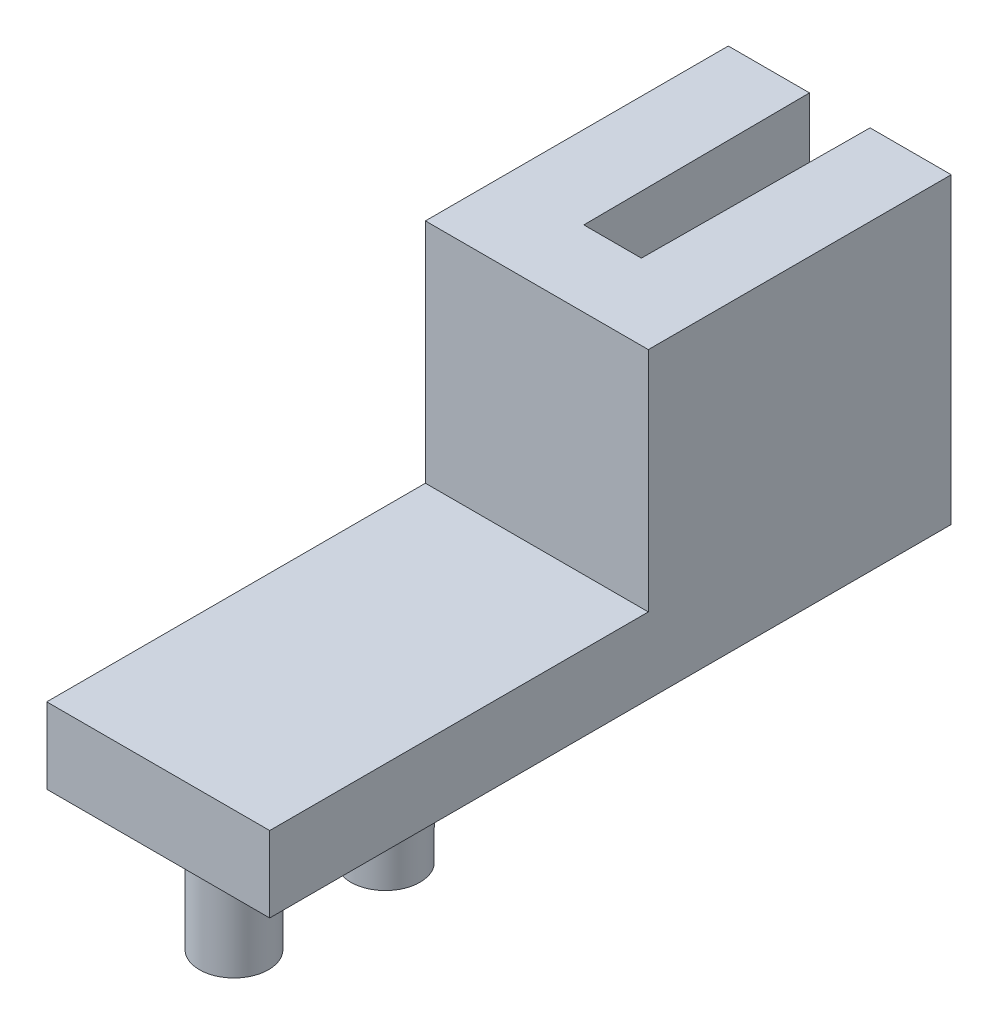
ISO-10303-21;
HEADER;
FILE_DESCRIPTION(('STEP AP214'),'2;1');
FILE_NAME('part.step','',(''),(''),'','','');
FILE_SCHEMA(('AUTOMOTIVE_DESIGN { 1 0 10303 214 1 1 1 1 }'));
ENDSEC;
DATA;
#1=APPLICATION_CONTEXT('core data for automotive mechanical design processes');
#2=APPLICATION_PROTOCOL_DEFINITION('international standard','automotive_design',2000,#1);
#3=PRODUCT_CONTEXT('',#1,'mechanical');
#4=PRODUCT('Part','Part','',(#3));
#5=PRODUCT_RELATED_PRODUCT_CATEGORY('part','',(#4));
#6=PRODUCT_DEFINITION_FORMATION('','',#4);
#7=PRODUCT_DEFINITION_CONTEXT('part definition',#1,'design');
#8=PRODUCT_DEFINITION('design','',#6,#7);
#9=PRODUCT_DEFINITION_SHAPE('','',#8);
#10=(LENGTH_UNIT() NAMED_UNIT(*) SI_UNIT(.MILLI.,.METRE.));
#11=(NAMED_UNIT(*) PLANE_ANGLE_UNIT() SI_UNIT($,.RADIAN.));
#12=(NAMED_UNIT(*) SI_UNIT($,.STERADIAN.) SOLID_ANGLE_UNIT());
#13=UNCERTAINTY_MEASURE_WITH_UNIT(LENGTH_MEASURE(1.E-05),#10,'distance_accuracy_value','');
#14=(GEOMETRIC_REPRESENTATION_CONTEXT(3) GLOBAL_UNCERTAINTY_ASSIGNED_CONTEXT((#13)) GLOBAL_UNIT_ASSIGNED_CONTEXT((#10,
#11,#12)) REPRESENTATION_CONTEXT('',''));
#15=CARTESIAN_POINT('',(0.,0.,0.));
#16=DIRECTION('',(0.,0.,1.));
#17=DIRECTION('',(1.,0.,0.));
#18=AXIS2_PLACEMENT_3D('',#15,#16,#17);
#19=CARTESIAN_POINT('',(9.3472,-3.175,0.));
#20=DIRECTION('',(0.,1.,0.));
#21=DIRECTION('',(0.,0.,1.));
#22=AXIS2_PLACEMENT_3D('',#19,#20,#21);
#23=PLANE('',#22);
#24=CARTESIAN_POINT('',(4.6736,-3.175,6.35));
#25=DIRECTION('',(0.,1.,0.));
#26=DIRECTION('',(0.,0.,1.));
#27=AXIS2_PLACEMENT_3D('',#24,#25,#26);
#28=CIRCLE('',#27,1.45);
#29=CARTESIAN_POINT('',(4.6736,-3.175,7.8));
#30=VERTEX_POINT('',#29);
#31=EDGE_CURVE('E11',#30,#30,#28,.F.);
#32=ORIENTED_EDGE('',*,*,#31,.F.);
#33=EDGE_LOOP('',(#32));
#34=FACE_BOUND('',#33,.T.);
#35=CARTESIAN_POINT('',(4.6736,-3.175,12.7));
#36=DIRECTION('',(0.,1.,0.));
#37=DIRECTION('',(0.,0.,1.));
#38=AXIS2_PLACEMENT_3D('',#35,#36,#37);
#39=CIRCLE('',#38,1.45);
#40=CARTESIAN_POINT('',(4.6736,-3.175,14.15));
#41=VERTEX_POINT('',#40);
#42=EDGE_CURVE('E49',#41,#41,#39,.F.);
#43=ORIENTED_EDGE('',*,*,#42,.F.);
#44=EDGE_LOOP('',(#43));
#45=FACE_BOUND('',#44,.T.);
#46=DIRECTION('',(-0.00666651852345663,0.,-0.999977778518491));
#47=VECTOR('',#46,1.);
#48=CARTESIAN_POINT('',(3.48811163948269,-3.175,-0.0232540775965513));
#49=LINE('',#48,#47);
#50=CARTESIAN_POINT('',(3.4671,-3.175,-3.175));
#51=VERTEX_POINT('',#50);
#52=CARTESIAN_POINT('',(3.4036,-3.175,-12.7));
#53=VERTEX_POINT('',#52);
#54=EDGE_CURVE('E191',#51,#53,#49,.T.);
#55=ORIENTED_EDGE('',*,*,#54,.F.);
#56=DIRECTION('',(1.,0.,0.));
#57=VECTOR('',#56,1.);
#58=CARTESIAN_POINT('',(0.,-3.175,-3.175));
#59=LINE('',#58,#57);
#60=CARTESIAN_POINT('',(5.8801,-3.175,-3.175));
#61=VERTEX_POINT('',#60);
#62=EDGE_CURVE('E195',#51,#61,#59,.T.);
#63=ORIENTED_EDGE('',*,*,#62,.T.);
#64=DIRECTION('',(0.00666651852345663,0.,-0.999977778518491));
#65=VECTOR('',#64,1.);
#66=CARTESIAN_POINT('',(5.85867294786898,-3.175,0.03905781965246));
#67=LINE('',#66,#65);
#68=CARTESIAN_POINT('',(5.9436,-3.175,-12.7));
#69=VERTEX_POINT('',#68);
#70=EDGE_CURVE('E204',#61,#69,#67,.T.);
#71=ORIENTED_EDGE('',*,*,#70,.T.);
#72=DIRECTION('',(-1.,0.,0.));
#73=VECTOR('',#72,1.);
#74=CARTESIAN_POINT('',(9.3472,-3.175,-12.7));
#75=LINE('',#74,#73);
#76=CARTESIAN_POINT('',(9.3472,-3.175,-12.7));
#77=VERTEX_POINT('',#76);
#78=EDGE_CURVE('E175',#77,#69,#75,.T.);
#79=ORIENTED_EDGE('',*,*,#78,.F.);
#80=DIRECTION('',(0.,0.,-1.));
#81=VECTOR('',#80,1.);
#82=CARTESIAN_POINT('',(9.3472,-3.175,0.));
#83=LINE('',#82,#81);
#84=CARTESIAN_POINT('',(9.3472,-3.175,15.875));
#85=VERTEX_POINT('',#84);
#86=EDGE_CURVE('E162',#85,#77,#83,.T.);
#87=ORIENTED_EDGE('',*,*,#86,.F.);
#88=DIRECTION('',(-1.,0.,0.));
#89=VECTOR('',#88,1.);
#90=CARTESIAN_POINT('',(9.3472,-3.175,15.875));
#91=LINE('',#90,#89);
#92=CARTESIAN_POINT('',(0.,-3.175,15.875));
#93=VERTEX_POINT('',#92);
#94=EDGE_CURVE('E138',#85,#93,#91,.T.);
#95=ORIENTED_EDGE('',*,*,#94,.T.);
#96=DIRECTION('',(0.,0.,-1.));
#97=VECTOR('',#96,1.);
#98=CARTESIAN_POINT('',(0.,-3.175,0.));
#99=LINE('',#98,#97);
#100=CARTESIAN_POINT('',(0.,-3.175,-12.7));
#101=VERTEX_POINT('',#100);
#102=EDGE_CURVE('E142',#93,#101,#99,.T.);
#103=ORIENTED_EDGE('',*,*,#102,.T.);
#104=EDGE_CURVE('E174',#53,#101,#75,.T.);
#105=ORIENTED_EDGE('',*,*,#104,.F.);
#106=EDGE_LOOP('',(#55,#63,#71,#79,#87,#95,#103,#105));
#107=FACE_BOUND('',#106,.T.);
#108=ADVANCED_FACE('F41',(#34,#45,#107),#23,.F.);
#109=CARTESIAN_POINT('',(9.3472,0.,-12.7));
#110=DIRECTION('',(0.,0.,1.));
#111=DIRECTION('',(1.,0.,0.));
#112=AXIS2_PLACEMENT_3D('',#109,#110,#111);
#113=PLANE('',#112);
#114=DIRECTION('',(0.,1.,0.));
#115=VECTOR('',#114,1.);
#116=CARTESIAN_POINT('',(3.4036,-3.175,-12.7));
#117=LINE('',#116,#115);
#118=CARTESIAN_POINT('',(3.4036,9.525,-12.7));
#119=VERTEX_POINT('',#118);
#120=EDGE_CURVE('E226',#53,#119,#117,.T.);
#121=ORIENTED_EDGE('',*,*,#120,.F.);
#122=ORIENTED_EDGE('',*,*,#104,.T.);
#123=DIRECTION('',(0.,1.,0.));
#124=VECTOR('',#123,1.);
#125=CARTESIAN_POINT('',(0.,0.,-12.7));
#126=LINE('',#125,#124);
#127=CARTESIAN_POINT('',(0.,9.525,-12.7));
#128=VERTEX_POINT('',#127);
#129=EDGE_CURVE('E146',#101,#128,#126,.T.);
#130=ORIENTED_EDGE('',*,*,#129,.T.);
#131=DIRECTION('',(-1.,0.,0.));
#132=VECTOR('',#131,1.);
#133=CARTESIAN_POINT('',(9.3472,9.525,-12.7));
#134=LINE('',#133,#132);
#135=EDGE_CURVE('E169',#119,#128,#134,.T.);
#136=ORIENTED_EDGE('',*,*,#135,.F.);
#137=EDGE_LOOP('',(#121,#122,#130,#136));
#138=FACE_BOUND('',#137,.T.);
#139=ADVANCED_FACE('F185',(#138),#113,.F.);
#140=CARTESIAN_POINT('',(9.3472,9.525,0.));
#141=DIRECTION('',(0.,1.,0.));
#142=DIRECTION('',(0.,0.,1.));
#143=AXIS2_PLACEMENT_3D('',#140,#141,#142);
#144=PLANE('',#143);
#145=DIRECTION('',(1.,0.,0.));
#146=VECTOR('',#145,1.);
#147=CARTESIAN_POINT('',(0.,9.525,-3.175));
#148=LINE('',#147,#146);
#149=CARTESIAN_POINT('',(3.4671,9.525,-3.175));
#150=VERTEX_POINT('',#149);
#151=CARTESIAN_POINT('',(5.8801,9.525,-3.175));
#152=VERTEX_POINT('',#151);
#153=EDGE_CURVE('E56',#150,#152,#148,.T.);
#154=ORIENTED_EDGE('',*,*,#153,.F.);
#155=DIRECTION('',(-0.00666651852345663,0.,-0.999977778518491));
#156=VECTOR('',#155,1.);
#157=CARTESIAN_POINT('',(3.48811163948269,9.525,-0.0232540775965513));
#158=LINE('',#157,#156);
#159=EDGE_CURVE('E220',#150,#119,#158,.T.);
#160=ORIENTED_EDGE('',*,*,#159,.T.);
#161=ORIENTED_EDGE('',*,*,#135,.T.);
#162=DIRECTION('',(0.,0.,-1.));
#163=VECTOR('',#162,1.);
#164=CARTESIAN_POINT('',(0.,9.525,0.));
#165=LINE('',#164,#163);
#166=CARTESIAN_POINT('',(0.,9.525,0.));
#167=VERTEX_POINT('',#166);
#168=EDGE_CURVE('E151',#167,#128,#165,.T.);
#169=ORIENTED_EDGE('',*,*,#168,.F.);
#170=DIRECTION('',(-1.,0.,0.));
#171=VECTOR('',#170,1.);
#172=CARTESIAN_POINT('',(9.3472,9.525,0.));
#173=LINE('',#172,#171);
#174=CARTESIAN_POINT('',(9.3472,9.525,0.));
#175=VERTEX_POINT('',#174);
#176=EDGE_CURVE('E124',#175,#167,#173,.T.);
#177=ORIENTED_EDGE('',*,*,#176,.F.);
#178=DIRECTION('',(0.,0.,-1.));
#179=VECTOR('',#178,1.);
#180=CARTESIAN_POINT('',(9.3472,9.525,0.));
#181=LINE('',#180,#179);
#182=CARTESIAN_POINT('',(9.3472,9.525,-12.7));
#183=VERTEX_POINT('',#182);
#184=EDGE_CURVE('E131',#175,#183,#181,.T.);
#185=ORIENTED_EDGE('',*,*,#184,.T.);
#186=CARTESIAN_POINT('',(5.9436,9.525,-12.7));
#187=VERTEX_POINT('',#186);
#188=EDGE_CURVE('E170',#183,#187,#134,.T.);
#189=ORIENTED_EDGE('',*,*,#188,.T.);
#190=DIRECTION('',(0.00666651852345663,0.,-0.999977778518491));
#191=VECTOR('',#190,1.);
#192=CARTESIAN_POINT('',(5.85867294786898,9.525,0.03905781965246));
#193=LINE('',#192,#191);
#194=EDGE_CURVE('E215',#152,#187,#193,.T.);
#195=ORIENTED_EDGE('',*,*,#194,.F.);
#196=EDGE_LOOP('',(#154,#160,#161,#169,#177,#185,#189,#195));
#197=FACE_BOUND('',#196,.T.);
#198=ADVANCED_FACE('F237',(#197),#144,.T.);
#199=ORIENTED_EDGE('',*,*,#78,.T.);
#200=DIRECTION('',(0.,1.,0.));
#201=VECTOR('',#200,1.);
#202=CARTESIAN_POINT('',(5.9436,-3.175,-12.7));
#203=LINE('',#202,#201);
#204=EDGE_CURVE('E208',#69,#187,#203,.T.);
#205=ORIENTED_EDGE('',*,*,#204,.T.);
#206=ORIENTED_EDGE('',*,*,#188,.F.);
#207=DIRECTION('',(0.,1.,0.));
#208=VECTOR('',#207,1.);
#209=CARTESIAN_POINT('',(9.3472,0.,-12.7));
#210=LINE('',#209,#208);
#211=EDGE_CURVE('E101',#77,#183,#210,.T.);
#212=ORIENTED_EDGE('',*,*,#211,.F.);
#213=EDGE_LOOP('',(#199,#205,#206,#212));
#214=FACE_BOUND('',#213,.T.);
#215=ADVANCED_FACE('F261',(#214),#113,.F.);
#216=CARTESIAN_POINT('',(9.3472,0.,0.));
#217=DIRECTION('',(0.,0.,1.));
#218=DIRECTION('',(0.,-1.,0.));
#219=AXIS2_PLACEMENT_3D('',#216,#217,#218);
#220=PLANE('',#219);
#221=DIRECTION('',(0.,1.,0.));
#222=VECTOR('',#221,1.);
#223=CARTESIAN_POINT('',(0.,0.,0.));
#224=LINE('',#223,#222);
#225=CARTESIAN_POINT('',(0.,0.,0.));
#226=VERTEX_POINT('',#225);
#227=EDGE_CURVE('E118',#226,#167,#224,.T.);
#228=ORIENTED_EDGE('',*,*,#227,.F.);
#229=DIRECTION('',(-1.,0.,0.));
#230=VECTOR('',#229,1.);
#231=CARTESIAN_POINT('',(9.3472,0.,0.));
#232=LINE('',#231,#230);
#233=CARTESIAN_POINT('',(9.3472,0.,0.));
#234=VERTEX_POINT('',#233);
#235=EDGE_CURVE('E113',#234,#226,#232,.T.);
#236=ORIENTED_EDGE('',*,*,#235,.F.);
#237=DIRECTION('',(0.,1.,0.));
#238=VECTOR('',#237,1.);
#239=CARTESIAN_POINT('',(9.3472,0.,0.));
#240=LINE('',#239,#238);
#241=EDGE_CURVE('E116',#234,#175,#240,.T.);
#242=ORIENTED_EDGE('',*,*,#241,.T.);
#243=ORIENTED_EDGE('',*,*,#176,.T.);
#244=EDGE_LOOP('',(#228,#236,#242,#243));
#245=FACE_BOUND('',#244,.T.);
#246=ADVANCED_FACE('F115',(#245),#220,.T.);
#247=CARTESIAN_POINT('',(9.3472,0.,0.));
#248=DIRECTION('',(0.,1.,0.));
#249=DIRECTION('',(0.,0.,1.));
#250=AXIS2_PLACEMENT_3D('',#247,#248,#249);
#251=PLANE('',#250);
#252=DIRECTION('',(0.,0.,-1.));
#253=VECTOR('',#252,1.);
#254=CARTESIAN_POINT('',(0.,0.,0.));
#255=LINE('',#254,#253);
#256=CARTESIAN_POINT('',(0.,0.,15.875));
#257=VERTEX_POINT('',#256);
#258=EDGE_CURVE('E157',#257,#226,#255,.T.);
#259=ORIENTED_EDGE('',*,*,#258,.F.);
#260=DIRECTION('',(-1.,0.,0.));
#261=VECTOR('',#260,1.);
#262=CARTESIAN_POINT('',(9.3472,0.,15.875));
#263=LINE('',#262,#261);
#264=CARTESIAN_POINT('',(9.3472,0.,15.875));
#265=VERTEX_POINT('',#264);
#266=EDGE_CURVE('E125',#265,#257,#263,.T.);
#267=ORIENTED_EDGE('',*,*,#266,.F.);
#268=DIRECTION('',(0.,0.,-1.));
#269=VECTOR('',#268,1.);
#270=CARTESIAN_POINT('',(9.3472,0.,0.));
#271=LINE('',#270,#269);
#272=EDGE_CURVE('E129',#265,#234,#271,.T.);
#273=ORIENTED_EDGE('',*,*,#272,.T.);
#274=ORIENTED_EDGE('',*,*,#235,.T.);
#275=EDGE_LOOP('',(#259,#267,#273,#274));
#276=FACE_BOUND('',#275,.T.);
#277=ADVANCED_FACE('F134',(#276),#251,.T.);
#278=CARTESIAN_POINT('',(9.3472,0.,15.875));
#279=DIRECTION('',(0.,0.,-1.));
#280=DIRECTION('',(0.,1.,0.));
#281=AXIS2_PLACEMENT_3D('',#278,#279,#280);
#282=PLANE('',#281);
#283=DIRECTION('',(0.,-1.,0.));
#284=VECTOR('',#283,1.);
#285=CARTESIAN_POINT('',(0.,0.,15.875));
#286=LINE('',#285,#284);
#287=EDGE_CURVE('E92',#257,#93,#286,.T.);
#288=ORIENTED_EDGE('',*,*,#287,.T.);
#289=ORIENTED_EDGE('',*,*,#94,.F.);
#290=DIRECTION('',(0.,-1.,0.));
#291=VECTOR('',#290,1.);
#292=CARTESIAN_POINT('',(9.3472,0.,15.875));
#293=LINE('',#292,#291);
#294=EDGE_CURVE('E65',#265,#85,#293,.T.);
#295=ORIENTED_EDGE('',*,*,#294,.F.);
#296=ORIENTED_EDGE('',*,*,#266,.T.);
#297=EDGE_LOOP('',(#288,#289,#295,#296));
#298=FACE_BOUND('',#297,.T.);
#299=ADVANCED_FACE('F248',(#298),#282,.F.);
#300=CARTESIAN_POINT('',(9.3472,0.,0.));
#301=DIRECTION('',(1.,0.,0.));
#302=DIRECTION('',(0.,0.,-1.));
#303=AXIS2_PLACEMENT_3D('',#300,#301,#302);
#304=PLANE('',#303);
#305=ORIENTED_EDGE('',*,*,#86,.T.);
#306=ORIENTED_EDGE('',*,*,#211,.T.);
#307=ORIENTED_EDGE('',*,*,#184,.F.);
#308=ORIENTED_EDGE('',*,*,#241,.F.);
#309=ORIENTED_EDGE('',*,*,#272,.F.);
#310=ORIENTED_EDGE('',*,*,#294,.T.);
#311=EDGE_LOOP('',(#305,#306,#307,#308,#309,#310));
#312=FACE_BOUND('',#311,.T.);
#313=ADVANCED_FACE('F128',(#312),#304,.T.);
#314=CARTESIAN_POINT('',(0.,0.,0.));
#315=DIRECTION('',(1.,0.,0.));
#316=DIRECTION('',(0.,0.,-1.));
#317=AXIS2_PLACEMENT_3D('',#314,#315,#316);
#318=PLANE('',#317);
#319=ORIENTED_EDGE('',*,*,#102,.F.);
#320=ORIENTED_EDGE('',*,*,#287,.F.);
#321=ORIENTED_EDGE('',*,*,#258,.T.);
#322=ORIENTED_EDGE('',*,*,#227,.T.);
#323=ORIENTED_EDGE('',*,*,#168,.T.);
#324=ORIENTED_EDGE('',*,*,#129,.F.);
#325=EDGE_LOOP('',(#319,#320,#321,#322,#323,#324));
#326=FACE_BOUND('',#325,.T.);
#327=ADVANCED_FACE('F245',(#326),#318,.F.);
#328=CARTESIAN_POINT('',(0.,-3.175,-3.175));
#329=DIRECTION('',(0.,0.,1.));
#330=DIRECTION('',(1.,0.,0.));
#331=AXIS2_PLACEMENT_3D('',#328,#329,#330);
#332=PLANE('',#331);
#333=ORIENTED_EDGE('',*,*,#153,.T.);
#334=DIRECTION('',(0.,1.,0.));
#335=VECTOR('',#334,1.);
#336=CARTESIAN_POINT('',(5.8801,-3.175,-3.175));
#337=LINE('',#336,#335);
#338=EDGE_CURVE('E203',#61,#152,#337,.T.);
#339=ORIENTED_EDGE('',*,*,#338,.F.);
#340=ORIENTED_EDGE('',*,*,#62,.F.);
#341=DIRECTION('',(0.,1.,0.));
#342=VECTOR('',#341,1.);
#343=CARTESIAN_POINT('',(3.4671,-3.175,-3.175));
#344=LINE('',#343,#342);
#345=EDGE_CURVE('E147',#51,#150,#344,.T.);
#346=ORIENTED_EDGE('',*,*,#345,.T.);
#347=EDGE_LOOP('',(#333,#339,#340,#346));
#348=FACE_BOUND('',#347,.T.);
#349=ADVANCED_FACE('F291',(#348),#332,.F.);
#350=CARTESIAN_POINT('',(3.48811163948269,-3.175,-0.0232540775965513));
#351=DIRECTION('',(0.999977778518491,0.,-0.00666651852345663));
#352=DIRECTION('',(-0.00666651852345663,0.,-0.999977778518491));
#353=AXIS2_PLACEMENT_3D('',#350,#351,#352);
#354=PLANE('',#353);
#355=ORIENTED_EDGE('',*,*,#159,.F.);
#356=ORIENTED_EDGE('',*,*,#345,.F.);
#357=ORIENTED_EDGE('',*,*,#54,.T.);
#358=ORIENTED_EDGE('',*,*,#120,.T.);
#359=EDGE_LOOP('',(#355,#356,#357,#358));
#360=FACE_BOUND('',#359,.T.);
#361=ADVANCED_FACE('F274',(#360),#354,.T.);
#362=CARTESIAN_POINT('',(5.85867294786898,-3.175,0.03905781965246));
#363=DIRECTION('',(0.999977778518491,0.,0.00666651852345663));
#364=DIRECTION('',(0.00666651852345663,0.,-0.999977778518491));
#365=AXIS2_PLACEMENT_3D('',#362,#363,#364);
#366=PLANE('',#365);
#367=ORIENTED_EDGE('',*,*,#194,.T.);
#368=ORIENTED_EDGE('',*,*,#204,.F.);
#369=ORIENTED_EDGE('',*,*,#70,.F.);
#370=ORIENTED_EDGE('',*,*,#338,.T.);
#371=EDGE_LOOP('',(#367,#368,#369,#370));
#372=FACE_BOUND('',#371,.T.);
#373=ADVANCED_FACE('F281',(#372),#366,.F.);
#374=CARTESIAN_POINT('',(4.6736,-8.255,12.7));
#375=DIRECTION('',(0.,1.,0.));
#376=DIRECTION('',(0.,0.,1.));
#377=AXIS2_PLACEMENT_3D('',#374,#375,#376);
#378=CYLINDRICAL_SURFACE('',#377,1.45);
#379=CARTESIAN_POINT('',(4.6736,-8.255,12.7));
#380=DIRECTION('',(0.,-1.,0.));
#381=DIRECTION('',(0.,0.,-1.));
#382=AXIS2_PLACEMENT_3D('',#379,#380,#381);
#383=CIRCLE('',#382,1.45);
#384=CARTESIAN_POINT('',(4.6736,-8.255,11.25));
#385=VERTEX_POINT('',#384);
#386=EDGE_CURVE('E216',#385,#385,#383,.T.);
#387=ORIENTED_EDGE('',*,*,#386,.F.);
#388=EDGE_LOOP('',(#387));
#389=FACE_BOUND('',#388,.T.);
#390=ORIENTED_EDGE('',*,*,#42,.T.);
#391=EDGE_LOOP('',(#390));
#392=FACE_BOUND('',#391,.T.);
#393=ADVANCED_FACE('F181',(#389,#392),#378,.T.);
#394=CARTESIAN_POINT('',(4.6736,-8.255,12.7));
#395=DIRECTION('',(0.,-1.,0.));
#396=DIRECTION('',(0.,0.,-1.));
#397=AXIS2_PLACEMENT_3D('',#394,#395,#396);
#398=PLANE('',#397);
#399=ORIENTED_EDGE('',*,*,#386,.T.);
#400=EDGE_LOOP('',(#399));
#401=FACE_BOUND('',#400,.T.);
#402=ADVANCED_FACE('F288',(#401),#398,.T.);
#403=CARTESIAN_POINT('',(4.6736,-8.255,6.35));
#404=DIRECTION('',(0.,1.,0.));
#405=DIRECTION('',(0.,0.,1.));
#406=AXIS2_PLACEMENT_3D('',#403,#404,#405);
#407=CYLINDRICAL_SURFACE('',#406,1.45);
#408=CARTESIAN_POINT('',(4.6736,-8.255,6.35));
#409=DIRECTION('',(0.,-1.,0.));
#410=DIRECTION('',(0.,0.,-1.));
#411=AXIS2_PLACEMENT_3D('',#408,#409,#410);
#412=CIRCLE('',#411,1.45);
#413=CARTESIAN_POINT('',(4.6736,-8.255,4.9));
#414=VERTEX_POINT('',#413);
#415=EDGE_CURVE('E394',#414,#414,#412,.T.);
#416=ORIENTED_EDGE('',*,*,#415,.F.);
#417=EDGE_LOOP('',(#416));
#418=FACE_BOUND('',#417,.T.);
#419=ORIENTED_EDGE('',*,*,#31,.T.);
#420=EDGE_LOOP('',(#419));
#421=FACE_BOUND('',#420,.T.);
#422=ADVANCED_FACE('F368',(#418,#421),#407,.T.);
#423=CARTESIAN_POINT('',(4.6736,-8.255,6.35));
#424=DIRECTION('',(0.,-1.,0.));
#425=DIRECTION('',(0.,0.,-1.));
#426=AXIS2_PLACEMENT_3D('',#423,#424,#425);
#427=PLANE('',#426);
#428=ORIENTED_EDGE('',*,*,#415,.T.);
#429=EDGE_LOOP('',(#428));
#430=FACE_BOUND('',#429,.T.);
#431=ADVANCED_FACE('F378',(#430),#427,.T.);
#432=CLOSED_SHELL('',(#108,#139,#198,#215,#246,#277,#299,#313,#327,#349,#361,#373,#393,#402,
#422,#431));
#433=MANIFOLD_SOLID_BREP('B2',#432);
#434=ADVANCED_BREP_SHAPE_REPRESENTATION('',(#18,#433),#14);
#435=SHAPE_DEFINITION_REPRESENTATION(#9,#434);
ENDSEC;
END-ISO-10303-21;
